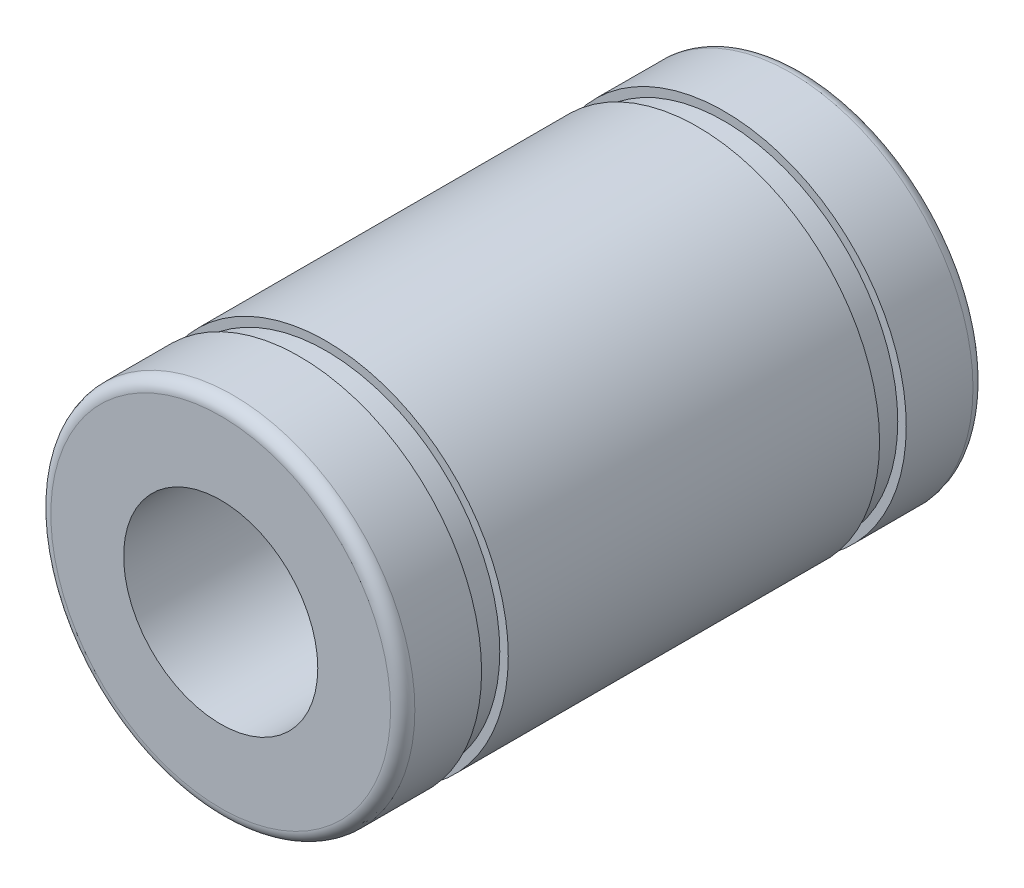
ISO-10303-21;
HEADER;
FILE_DESCRIPTION(('STEP AP214'),'2;1');
FILE_NAME('part.step','',(''),(''),'','','');
FILE_SCHEMA(('AUTOMOTIVE_DESIGN { 1 0 10303 214 1 1 1 1 }'));
ENDSEC;
DATA;
#1=APPLICATION_CONTEXT('core data for automotive mechanical design processes');
#2=APPLICATION_PROTOCOL_DEFINITION('international standard','automotive_design',2000,#1);
#3=PRODUCT_CONTEXT('',#1,'mechanical');
#4=PRODUCT('Part','Part','',(#3));
#5=PRODUCT_RELATED_PRODUCT_CATEGORY('part','',(#4));
#6=PRODUCT_DEFINITION_FORMATION('','',#4);
#7=PRODUCT_DEFINITION_CONTEXT('part definition',#1,'design');
#8=PRODUCT_DEFINITION('design','',#6,#7);
#9=PRODUCT_DEFINITION_SHAPE('','',#8);
#10=(LENGTH_UNIT() NAMED_UNIT(*) SI_UNIT(.MILLI.,.METRE.));
#11=(NAMED_UNIT(*) PLANE_ANGLE_UNIT() SI_UNIT($,.RADIAN.));
#12=(NAMED_UNIT(*) SI_UNIT($,.STERADIAN.) SOLID_ANGLE_UNIT());
#13=UNCERTAINTY_MEASURE_WITH_UNIT(LENGTH_MEASURE(1.E-05),#10,'distance_accuracy_value','');
#14=(GEOMETRIC_REPRESENTATION_CONTEXT(3) GLOBAL_UNCERTAINTY_ASSIGNED_CONTEXT((#13)) GLOBAL_UNIT_ASSIGNED_CONTEXT((#10,
#11,#12)) REPRESENTATION_CONTEXT('',''));
#15=CARTESIAN_POINT('',(0.,0.,0.));
#16=DIRECTION('',(0.,0.,1.));
#17=DIRECTION('',(1.,0.,0.));
#18=AXIS2_PLACEMENT_3D('',#15,#16,#17);
#19=CARTESIAN_POINT('',(0.,-7.5,12.));
#20=DIRECTION('',(0.,0.,1.));
#21=DIRECTION('',(1.,0.,0.));
#22=AXIS2_PLACEMENT_3D('',#19,#20,#21);
#23=PLANE('',#22);
#24=CARTESIAN_POINT('',(0.,0.,12.));
#25=DIRECTION('',(0.,0.,1.));
#26=DIRECTION('',(1.,0.,0.));
#27=AXIS2_PLACEMENT_3D('',#24,#25,#26);
#28=CIRCLE('',#27,7.);
#29=CARTESIAN_POINT('',(7.,0.,12.));
#30=VERTEX_POINT('',#29);
#31=EDGE_CURVE('E46',#30,#30,#28,.T.);
#32=ORIENTED_EDGE('',*,*,#31,.T.);
#33=EDGE_LOOP('',(#32));
#34=FACE_BOUND('',#33,.T.);
#35=CARTESIAN_POINT('',(0.,0.,12.));
#36=DIRECTION('',(0.,0.,1.));
#37=DIRECTION('',(1.,0.,0.));
#38=AXIS2_PLACEMENT_3D('',#35,#36,#37);
#39=CIRCLE('',#38,4.);
#40=CARTESIAN_POINT('',(4.,0.,12.));
#41=VERTEX_POINT('',#40);
#42=EDGE_CURVE('E51',#41,#41,#39,.T.);
#43=ORIENTED_EDGE('',*,*,#42,.F.);
#44=EDGE_LOOP('',(#43));
#45=FACE_BOUND('',#44,.T.);
#46=ADVANCED_FACE('F31',(#34,#45),#23,.T.);
#47=CARTESIAN_POINT('',(0.,0.,1000.));
#48=DIRECTION('',(0.,0.,1.));
#49=DIRECTION('',(1.,0.,0.));
#50=AXIS2_PLACEMENT_3D('',#47,#48,#49);
#51=CYLINDRICAL_SURFACE('',#50,4.);
#52=ORIENTED_EDGE('',*,*,#42,.T.);
#53=EDGE_LOOP('',(#52));
#54=FACE_BOUND('',#53,.T.);
#55=CARTESIAN_POINT('',(0.,0.,-12.));
#56=DIRECTION('',(0.,0.,1.));
#57=DIRECTION('',(1.,0.,0.));
#58=AXIS2_PLACEMENT_3D('',#55,#56,#57);
#59=CIRCLE('',#58,4.);
#60=CARTESIAN_POINT('',(4.,0.,-12.));
#61=VERTEX_POINT('',#60);
#62=EDGE_CURVE('E66',#61,#61,#59,.T.);
#63=ORIENTED_EDGE('',*,*,#62,.F.);
#64=EDGE_LOOP('',(#63));
#65=FACE_BOUND('',#64,.T.);
#66=ADVANCED_FACE('F96',(#54,#65),#51,.F.);
#67=CARTESIAN_POINT('',(0.,0.,1000.));
#68=DIRECTION('',(0.,0.,1.));
#69=DIRECTION('',(1.,0.,0.));
#70=AXIS2_PLACEMENT_3D('',#67,#68,#69);
#71=CYLINDRICAL_SURFACE('',#70,7.5);
#72=CARTESIAN_POINT('',(0.,0.,7.65000000000005));
#73=DIRECTION('',(0.,0.,1.));
#74=DIRECTION('',(1.,0.,0.));
#75=AXIS2_PLACEMENT_3D('',#72,#73,#74);
#76=CIRCLE('',#75,7.5);
#77=CARTESIAN_POINT('',(7.5,0.,7.65000000000005));
#78=VERTEX_POINT('',#77);
#79=EDGE_CURVE('E54',#78,#78,#76,.T.);
#80=ORIENTED_EDGE('',*,*,#79,.F.);
#81=EDGE_LOOP('',(#80));
#82=FACE_BOUND('',#81,.T.);
#83=CARTESIAN_POINT('',(0.,0.,-7.65000000000005));
#84=DIRECTION('',(0.,0.,1.));
#85=DIRECTION('',(1.,0.,0.));
#86=AXIS2_PLACEMENT_3D('',#83,#84,#85);
#87=CIRCLE('',#86,7.5);
#88=CARTESIAN_POINT('',(7.5,0.,-7.65000000000005));
#89=VERTEX_POINT('',#88);
#90=EDGE_CURVE('E69',#89,#89,#87,.T.);
#91=ORIENTED_EDGE('',*,*,#90,.T.);
#92=EDGE_LOOP('',(#91));
#93=FACE_BOUND('',#92,.T.);
#94=ADVANCED_FACE('F102',(#82,#93),#71,.T.);
#95=CARTESIAN_POINT('',(0.,-7.5,7.65000000000002));
#96=DIRECTION('',(0.,0.,1.));
#97=DIRECTION('',(1.,0.,0.));
#98=AXIS2_PLACEMENT_3D('',#95,#96,#97);
#99=PLANE('',#98);
#100=ORIENTED_EDGE('',*,*,#79,.T.);
#101=EDGE_LOOP('',(#100));
#102=FACE_BOUND('',#101,.T.);
#103=CARTESIAN_POINT('',(0.,0.,7.65000000000005));
#104=DIRECTION('',(0.,0.,1.));
#105=DIRECTION('',(1.,0.,0.));
#106=AXIS2_PLACEMENT_3D('',#103,#104,#105);
#107=CIRCLE('',#106,7.15);
#108=CARTESIAN_POINT('',(7.15,0.,7.65000000000005));
#109=VERTEX_POINT('',#108);
#110=EDGE_CURVE('E57',#109,#109,#107,.T.);
#111=ORIENTED_EDGE('',*,*,#110,.F.);
#112=EDGE_LOOP('',(#111));
#113=FACE_BOUND('',#112,.T.);
#114=ADVANCED_FACE('F134',(#102,#113),#99,.T.);
#115=CARTESIAN_POINT('',(0.,0.,1000.));
#116=DIRECTION('',(0.,0.,1.));
#117=DIRECTION('',(1.,0.,0.));
#118=AXIS2_PLACEMENT_3D('',#115,#116,#117);
#119=CYLINDRICAL_SURFACE('',#118,7.15);
#120=ORIENTED_EDGE('',*,*,#110,.T.);
#121=EDGE_LOOP('',(#120));
#122=FACE_BOUND('',#121,.T.);
#123=CARTESIAN_POINT('',(0.,0.,8.75000000000004));
#124=DIRECTION('',(0.,0.,1.));
#125=DIRECTION('',(1.,0.,0.));
#126=AXIS2_PLACEMENT_3D('',#123,#124,#125);
#127=CIRCLE('',#126,7.15);
#128=CARTESIAN_POINT('',(7.15,0.,8.75000000000004));
#129=VERTEX_POINT('',#128);
#130=EDGE_CURVE('E60',#129,#129,#127,.T.);
#131=ORIENTED_EDGE('',*,*,#130,.F.);
#132=EDGE_LOOP('',(#131));
#133=FACE_BOUND('',#132,.T.);
#134=ADVANCED_FACE('F128',(#122,#133),#119,.T.);
#135=CARTESIAN_POINT('',(0.,-7.5,8.75));
#136=DIRECTION('',(0.,0.,-1.));
#137=DIRECTION('',(-1.,0.,0.));
#138=AXIS2_PLACEMENT_3D('',#135,#136,#137);
#139=PLANE('',#138);
#140=ORIENTED_EDGE('',*,*,#130,.T.);
#141=EDGE_LOOP('',(#140));
#142=FACE_BOUND('',#141,.T.);
#143=CARTESIAN_POINT('',(0.,0.,8.75000000000004));
#144=DIRECTION('',(0.,0.,1.));
#145=DIRECTION('',(1.,0.,0.));
#146=AXIS2_PLACEMENT_3D('',#143,#144,#145);
#147=CIRCLE('',#146,7.5);
#148=CARTESIAN_POINT('',(7.5,0.,8.75000000000004));
#149=VERTEX_POINT('',#148);
#150=EDGE_CURVE('E63',#149,#149,#147,.T.);
#151=ORIENTED_EDGE('',*,*,#150,.F.);
#152=EDGE_LOOP('',(#151));
#153=FACE_BOUND('',#152,.T.);
#154=ADVANCED_FACE('F118',(#142,#153),#139,.T.);
#155=CARTESIAN_POINT('',(0.,0.,1000.));
#156=DIRECTION('',(0.,0.,1.));
#157=DIRECTION('',(1.,0.,0.));
#158=AXIS2_PLACEMENT_3D('',#155,#156,#157);
#159=CYLINDRICAL_SURFACE('',#158,7.5);
#160=CARTESIAN_POINT('',(0.,0.,11.5));
#161=DIRECTION('',(0.,0.,1.));
#162=DIRECTION('',(1.,0.,0.));
#163=AXIS2_PLACEMENT_3D('',#160,#161,#162);
#164=CIRCLE('',#163,7.5);
#165=CARTESIAN_POINT('',(7.5,0.,11.5));
#166=VERTEX_POINT('',#165);
#167=EDGE_CURVE('E42',#166,#166,#164,.F.);
#168=ORIENTED_EDGE('',*,*,#167,.T.);
#169=EDGE_LOOP('',(#168));
#170=FACE_BOUND('',#169,.T.);
#171=ORIENTED_EDGE('',*,*,#150,.T.);
#172=EDGE_LOOP('',(#171));
#173=FACE_BOUND('',#172,.T.);
#174=ADVANCED_FACE('F110',(#170,#173),#159,.T.);
#175=CARTESIAN_POINT('',(0.,0.,11.5));
#176=DIRECTION('',(0.,0.,1.));
#177=DIRECTION('',(1.,0.,0.));
#178=AXIS2_PLACEMENT_3D('',#175,#176,#177);
#179=TOROIDAL_SURFACE('',#178,7.,0.5);
#180=ORIENTED_EDGE('',*,*,#167,.F.);
#181=EDGE_LOOP('',(#180));
#182=FACE_BOUND('',#181,.T.);
#183=ORIENTED_EDGE('',*,*,#31,.F.);
#184=EDGE_LOOP('',(#183));
#185=FACE_BOUND('',#184,.T.);
#186=ADVANCED_FACE('F107',(#182,#185),#179,.T.);
#187=CARTESIAN_POINT('',(0.,-7.5,-12.));
#188=DIRECTION('',(0.,0.,-1.));
#189=DIRECTION('',(1.,0.,0.));
#190=AXIS2_PLACEMENT_3D('',#187,#188,#189);
#191=PLANE('',#190);
#192=CARTESIAN_POINT('',(0.,0.,-12.));
#193=DIRECTION('',(0.,0.,-1.));
#194=DIRECTION('',(-1.,0.,0.));
#195=AXIS2_PLACEMENT_3D('',#192,#193,#194);
#196=CIRCLE('',#195,7.);
#197=CARTESIAN_POINT('',(-7.,0.,-12.));
#198=VERTEX_POINT('',#197);
#199=EDGE_CURVE('E10',#198,#198,#196,.T.);
#200=ORIENTED_EDGE('',*,*,#199,.T.);
#201=EDGE_LOOP('',(#200));
#202=FACE_BOUND('',#201,.T.);
#203=ORIENTED_EDGE('',*,*,#62,.T.);
#204=EDGE_LOOP('',(#203));
#205=FACE_BOUND('',#204,.T.);
#206=ADVANCED_FACE('F109',(#202,#205),#191,.T.);
#207=CARTESIAN_POINT('',(0.,-7.5,-7.65000000000002));
#208=DIRECTION('',(0.,0.,-1.));
#209=DIRECTION('',(1.,0.,0.));
#210=AXIS2_PLACEMENT_3D('',#207,#208,#209);
#211=PLANE('',#210);
#212=ORIENTED_EDGE('',*,*,#90,.F.);
#213=EDGE_LOOP('',(#212));
#214=FACE_BOUND('',#213,.T.);
#215=CARTESIAN_POINT('',(0.,0.,-7.65000000000005));
#216=DIRECTION('',(0.,0.,1.));
#217=DIRECTION('',(1.,0.,0.));
#218=AXIS2_PLACEMENT_3D('',#215,#216,#217);
#219=CIRCLE('',#218,7.15);
#220=CARTESIAN_POINT('',(7.15,0.,-7.65000000000005));
#221=VERTEX_POINT('',#220);
#222=EDGE_CURVE('E72',#221,#221,#219,.T.);
#223=ORIENTED_EDGE('',*,*,#222,.T.);
#224=EDGE_LOOP('',(#223));
#225=FACE_BOUND('',#224,.T.);
#226=ADVANCED_FACE('F116',(#214,#225),#211,.T.);
#227=CARTESIAN_POINT('',(0.,0.,-1000.));
#228=DIRECTION('',(0.,0.,-1.));
#229=DIRECTION('',(1.,0.,0.));
#230=AXIS2_PLACEMENT_3D('',#227,#228,#229);
#231=CYLINDRICAL_SURFACE('',#230,7.15);
#232=ORIENTED_EDGE('',*,*,#222,.F.);
#233=EDGE_LOOP('',(#232));
#234=FACE_BOUND('',#233,.T.);
#235=CARTESIAN_POINT('',(0.,0.,-8.75000000000004));
#236=DIRECTION('',(0.,0.,1.));
#237=DIRECTION('',(1.,0.,0.));
#238=AXIS2_PLACEMENT_3D('',#235,#236,#237);
#239=CIRCLE('',#238,7.15);
#240=CARTESIAN_POINT('',(7.15,0.,-8.75000000000004));
#241=VERTEX_POINT('',#240);
#242=EDGE_CURVE('E75',#241,#241,#239,.T.);
#243=ORIENTED_EDGE('',*,*,#242,.T.);
#244=EDGE_LOOP('',(#243));
#245=FACE_BOUND('',#244,.T.);
#246=ADVANCED_FACE('F92',(#234,#245),#231,.T.);
#247=CARTESIAN_POINT('',(0.,-7.5,-8.75));
#248=DIRECTION('',(0.,0.,1.));
#249=DIRECTION('',(-1.,0.,0.));
#250=AXIS2_PLACEMENT_3D('',#247,#248,#249);
#251=PLANE('',#250);
#252=ORIENTED_EDGE('',*,*,#242,.F.);
#253=EDGE_LOOP('',(#252));
#254=FACE_BOUND('',#253,.T.);
#255=CARTESIAN_POINT('',(0.,0.,-8.75000000000004));
#256=DIRECTION('',(0.,0.,1.));
#257=DIRECTION('',(1.,0.,0.));
#258=AXIS2_PLACEMENT_3D('',#255,#256,#257);
#259=CIRCLE('',#258,7.5);
#260=CARTESIAN_POINT('',(7.5,0.,-8.75000000000004));
#261=VERTEX_POINT('',#260);
#262=EDGE_CURVE('E78',#261,#261,#259,.T.);
#263=ORIENTED_EDGE('',*,*,#262,.T.);
#264=EDGE_LOOP('',(#263));
#265=FACE_BOUND('',#264,.T.);
#266=ADVANCED_FACE('F82',(#254,#265),#251,.T.);
#267=CARTESIAN_POINT('',(0.,0.,-1000.));
#268=DIRECTION('',(0.,0.,-1.));
#269=DIRECTION('',(1.,0.,0.));
#270=AXIS2_PLACEMENT_3D('',#267,#268,#269);
#271=CYLINDRICAL_SURFACE('',#270,7.5);
#272=CARTESIAN_POINT('',(0.,0.,-11.5));
#273=DIRECTION('',(0.,0.,-1.));
#274=DIRECTION('',(-1.,0.,0.));
#275=AXIS2_PLACEMENT_3D('',#272,#273,#274);
#276=CIRCLE('',#275,7.5);
#277=CARTESIAN_POINT('',(-7.5,0.,-11.5));
#278=VERTEX_POINT('',#277);
#279=EDGE_CURVE('E38',#278,#278,#276,.F.);
#280=ORIENTED_EDGE('',*,*,#279,.T.);
#281=EDGE_LOOP('',(#280));
#282=FACE_BOUND('',#281,.T.);
#283=ORIENTED_EDGE('',*,*,#262,.F.);
#284=EDGE_LOOP('',(#283));
#285=FACE_BOUND('',#284,.T.);
#286=ADVANCED_FACE('F84',(#282,#285),#271,.T.);
#287=CARTESIAN_POINT('',(0.,0.,-11.5));
#288=DIRECTION('',(0.,0.,-1.));
#289=DIRECTION('',(-1.,0.,0.));
#290=AXIS2_PLACEMENT_3D('',#287,#288,#289);
#291=TOROIDAL_SURFACE('',#290,7.,0.5);
#292=ORIENTED_EDGE('',*,*,#199,.F.);
#293=EDGE_LOOP('',(#292));
#294=FACE_BOUND('',#293,.T.);
#295=ORIENTED_EDGE('',*,*,#279,.F.);
#296=EDGE_LOOP('',(#295));
#297=FACE_BOUND('',#296,.T.);
#298=ADVANCED_FACE('F33',(#294,#297),#291,.T.);
#299=CLOSED_SHELL('',(#46,#66,#94,#114,#134,#154,#174,#186,#206,#226,#246,#266,#286,#298));
#300=MANIFOLD_SOLID_BREP('B2',#299);
#301=ADVANCED_BREP_SHAPE_REPRESENTATION('',(#18,#300),#14);
#302=SHAPE_DEFINITION_REPRESENTATION(#9,#301);
ENDSEC;
END-ISO-10303-21;
